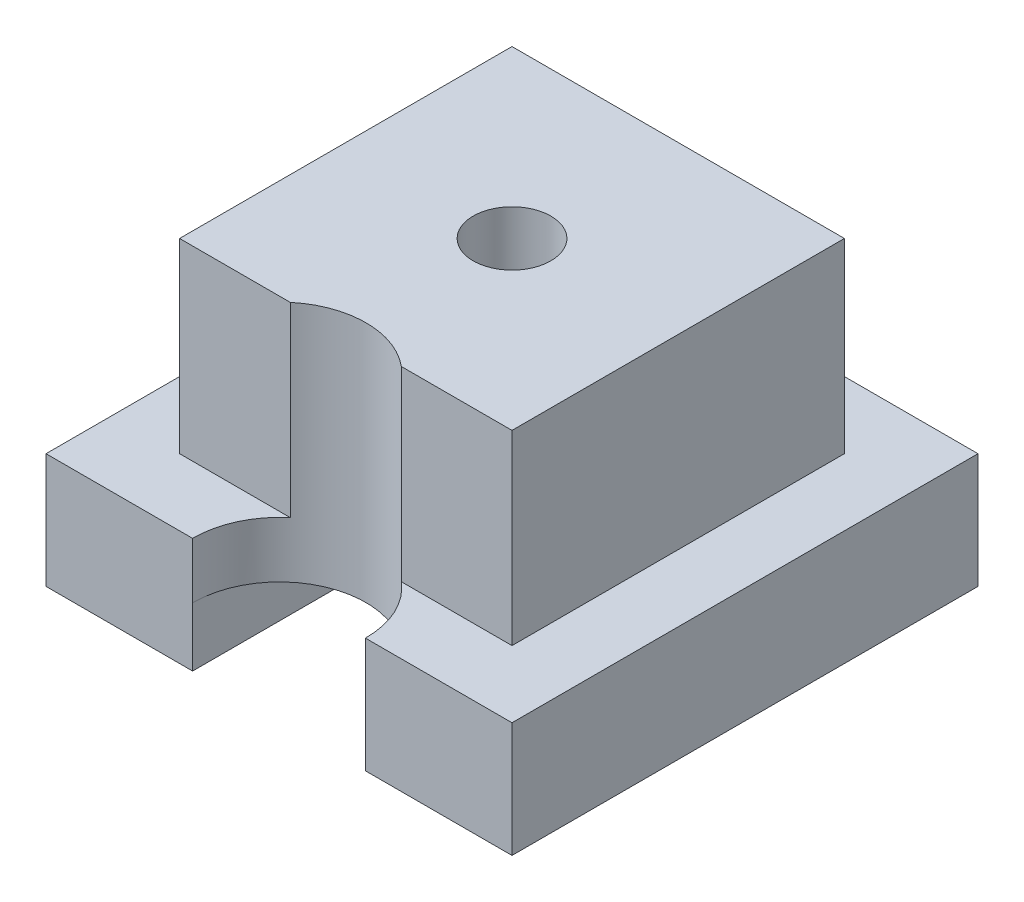
ISO-10303-21;
HEADER;
FILE_DESCRIPTION(('STEP AP214'),'2;1');
FILE_NAME('part.step','',(''),(''),'','','');
FILE_SCHEMA(('AUTOMOTIVE_DESIGN { 1 0 10303 214 1 1 1 1 }'));
ENDSEC;
DATA;
#1=APPLICATION_CONTEXT('core data for automotive mechanical design processes');
#2=APPLICATION_PROTOCOL_DEFINITION('international standard','automotive_design',2000,#1);
#3=PRODUCT_CONTEXT('',#1,'mechanical');
#4=PRODUCT('Part','Part','',(#3));
#5=PRODUCT_RELATED_PRODUCT_CATEGORY('part','',(#4));
#6=PRODUCT_DEFINITION_FORMATION('','',#4);
#7=PRODUCT_DEFINITION_CONTEXT('part definition',#1,'design');
#8=PRODUCT_DEFINITION('design','',#6,#7);
#9=PRODUCT_DEFINITION_SHAPE('','',#8);
#10=(LENGTH_UNIT() NAMED_UNIT(*) SI_UNIT(.MILLI.,.METRE.));
#11=(NAMED_UNIT(*) PLANE_ANGLE_UNIT() SI_UNIT($,.RADIAN.));
#12=(NAMED_UNIT(*) SI_UNIT($,.STERADIAN.) SOLID_ANGLE_UNIT());
#13=UNCERTAINTY_MEASURE_WITH_UNIT(LENGTH_MEASURE(1.E-05),#10,'distance_accuracy_value','');
#14=(GEOMETRIC_REPRESENTATION_CONTEXT(3) GLOBAL_UNCERTAINTY_ASSIGNED_CONTEXT((#13)) GLOBAL_UNIT_ASSIGNED_CONTEXT((#10,
#11,#12)) REPRESENTATION_CONTEXT('',''));
#15=CARTESIAN_POINT('',(0.,0.,0.));
#16=DIRECTION('',(0.,0.,1.));
#17=DIRECTION('',(1.,0.,0.));
#18=AXIS2_PLACEMENT_3D('',#15,#16,#17);
#19=CARTESIAN_POINT('',(0.,0.,0.));
#20=DIRECTION('',(0.,1.,0.));
#21=DIRECTION('',(0.,0.,1.));
#22=AXIS2_PLACEMENT_3D('',#19,#20,#21);
#23=PLANE('',#22);
#24=CARTESIAN_POINT('',(0.,0.,0.));
#25=DIRECTION('',(0.,-1.,0.));
#26=DIRECTION('',(0.,0.,-1.));
#27=AXIS2_PLACEMENT_3D('',#24,#25,#26);
#28=CIRCLE('',#27,3.175);
#29=CARTESIAN_POINT('',(0.,0.,-3.175));
#30=VERTEX_POINT('',#29);
#31=EDGE_CURVE('E272',#30,#30,#28,.T.);
#32=ORIENTED_EDGE('',*,*,#31,.F.);
#33=EDGE_LOOP('',(#32));
#34=FACE_BOUND('',#33,.T.);
#35=DIRECTION('',(0.,0.,1.));
#36=VECTOR('',#35,1.);
#37=CARTESIAN_POINT('',(-7.06332300168908,0.,-19.05));
#38=LINE('',#37,#36);
#39=CARTESIAN_POINT('',(-7.06332300168908,0.,-19.05));
#40=VERTEX_POINT('',#39);
#41=CARTESIAN_POINT('',(-7.06332300168908,0.,18.9499999999997));
#42=VERTEX_POINT('',#41);
#43=EDGE_CURVE('E90',#40,#42,#38,.T.);
#44=ORIENTED_EDGE('',*,*,#43,.F.);
#45=DIRECTION('',(-1.,0.,0.));
#46=VECTOR('',#45,1.);
#47=CARTESIAN_POINT('',(-19.05,0.,-19.05));
#48=LINE('',#47,#46);
#49=CARTESIAN_POINT('',(7.06332300168908,0.,-19.05));
#50=VERTEX_POINT('',#49);
#51=EDGE_CURVE('E338',#50,#40,#48,.T.);
#52=ORIENTED_EDGE('',*,*,#51,.F.);
#53=DIRECTION('',(0.,0.,-1.));
#54=VECTOR('',#53,1.);
#55=CARTESIAN_POINT('',(7.06332300168908,0.,-19.05));
#56=LINE('',#55,#54);
#57=CARTESIAN_POINT('',(7.06332300168908,0.,18.9499999999999));
#58=VERTEX_POINT('',#57);
#59=EDGE_CURVE('E12',#58,#50,#56,.T.);
#60=ORIENTED_EDGE('',*,*,#59,.F.);
#61=CARTESIAN_POINT('',(0.,0.,19.));
#62=DIRECTION('',(0.,-1.,0.));
#63=DIRECTION('',(0.,0.,-1.));
#64=AXIS2_PLACEMENT_3D('',#61,#62,#63);
#65=CIRCLE('',#64,7.06349997);
#66=EDGE_CURVE('E97',#42,#58,#65,.T.);
#67=ORIENTED_EDGE('',*,*,#66,.F.);
#68=EDGE_LOOP('',(#44,#52,#60,#67));
#69=FACE_BOUND('',#68,.T.);
#70=ADVANCED_FACE('F72',(#34,#69),#23,.F.);
#71=CARTESIAN_POINT('',(-19.05,4.572,19.05));
#72=DIRECTION('',(0.,0.,-1.));
#73=DIRECTION('',(-1.,0.,0.));
#74=AXIS2_PLACEMENT_3D('',#71,#72,#73);
#75=PLANE('',#74);
#76=DIRECTION('',(1.,0.,0.));
#77=VECTOR('',#76,1.);
#78=CARTESIAN_POINT('',(-19.05,4.572,19.05));
#79=LINE('',#78,#77);
#80=CARTESIAN_POINT('',(7.06332300168908,4.572,19.05));
#81=VERTEX_POINT('',#80);
#82=CARTESIAN_POINT('',(19.05,4.572,19.05));
#83=VERTEX_POINT('',#82);
#84=EDGE_CURVE('E347',#81,#83,#79,.T.);
#85=ORIENTED_EDGE('',*,*,#84,.F.);
#86=DIRECTION('',(0.,-1.,0.));
#87=VECTOR('',#86,1.);
#88=CARTESIAN_POINT('',(7.06332300168908,19.812,19.05));
#89=LINE('',#88,#87);
#90=CARTESIAN_POINT('',(7.06332300168908,0.,19.05));
#91=VERTEX_POINT('',#90);
#92=EDGE_CURVE('E300',#81,#91,#89,.T.);
#93=ORIENTED_EDGE('',*,*,#92,.T.);
#94=DIRECTION('',(0.,1.,0.));
#95=VECTOR('',#94,1.);
#96=CARTESIAN_POINT('',(7.06332300168908,-4.826,19.05));
#97=LINE('',#96,#95);
#98=CARTESIAN_POINT('',(7.06332300168908,-4.826,19.05));
#99=VERTEX_POINT('',#98);
#100=EDGE_CURVE('E282',#99,#91,#97,.T.);
#101=ORIENTED_EDGE('',*,*,#100,.F.);
#102=DIRECTION('',(-1.,0.,0.));
#103=VECTOR('',#102,1.);
#104=CARTESIAN_POINT('',(19.05,-4.826,19.05));
#105=LINE('',#104,#103);
#106=CARTESIAN_POINT('',(19.05,-4.826,19.05));
#107=VERTEX_POINT('',#106);
#108=EDGE_CURVE('E422',#107,#99,#105,.T.);
#109=ORIENTED_EDGE('',*,*,#108,.F.);
#110=DIRECTION('',(0.,-1.,0.));
#111=VECTOR('',#110,1.);
#112=CARTESIAN_POINT('',(19.05,4.572,19.05));
#113=LINE('',#112,#111);
#114=EDGE_CURVE('E351',#83,#107,#113,.T.);
#115=ORIENTED_EDGE('',*,*,#114,.F.);
#116=EDGE_LOOP('',(#85,#93,#101,#109,#115));
#117=FACE_BOUND('',#116,.T.);
#118=ADVANCED_FACE('F423',(#117),#75,.F.);
#119=CARTESIAN_POINT('',(-13.589,19.812,13.589));
#120=DIRECTION('',(0.,0.,-1.));
#121=DIRECTION('',(-1.,0.,0.));
#122=AXIS2_PLACEMENT_3D('',#119,#120,#121);
#123=PLANE('',#122);
#124=DIRECTION('',(1.,0.,0.));
#125=VECTOR('',#124,1.);
#126=CARTESIAN_POINT('',(-13.589,19.812,13.589));
#127=LINE('',#126,#125);
#128=CARTESIAN_POINT('',(4.54027651428743,19.812,13.589));
#129=VERTEX_POINT('',#128);
#130=CARTESIAN_POINT('',(13.589,19.812,13.589));
#131=VERTEX_POINT('',#130);
#132=EDGE_CURVE('E306',#129,#131,#127,.T.);
#133=ORIENTED_EDGE('',*,*,#132,.F.);
#134=DIRECTION('',(0.,-1.,0.));
#135=VECTOR('',#134,1.);
#136=CARTESIAN_POINT('',(4.54027651428744,19.812,13.589));
#137=LINE('',#136,#135);
#138=CARTESIAN_POINT('',(4.54027651428744,4.572,13.589));
#139=VERTEX_POINT('',#138);
#140=EDGE_CURVE('E293',#129,#139,#137,.T.);
#141=ORIENTED_EDGE('',*,*,#140,.T.);
#142=DIRECTION('',(-1.,0.,0.));
#143=VECTOR('',#142,1.);
#144=CARTESIAN_POINT('',(0.,4.572,13.589));
#145=LINE('',#144,#143);
#146=CARTESIAN_POINT('',(13.589,4.572,13.589));
#147=VERTEX_POINT('',#146);
#148=EDGE_CURVE('E324',#147,#139,#145,.T.);
#149=ORIENTED_EDGE('',*,*,#148,.F.);
#150=DIRECTION('',(0.,-1.,0.));
#151=VECTOR('',#150,1.);
#152=CARTESIAN_POINT('',(13.589,19.812,13.589));
#153=LINE('',#152,#151);
#154=EDGE_CURVE('E310',#131,#147,#153,.T.);
#155=ORIENTED_EDGE('',*,*,#154,.F.);
#156=EDGE_LOOP('',(#133,#141,#149,#155));
#157=FACE_BOUND('',#156,.T.);
#158=ADVANCED_FACE('F399',(#157),#123,.F.);
#159=CARTESIAN_POINT('',(0.,4.572,0.));
#160=DIRECTION('',(0.,1.,0.));
#161=DIRECTION('',(0.,0.,1.));
#162=AXIS2_PLACEMENT_3D('',#159,#160,#161);
#163=PLANE('',#162);
#164=CARTESIAN_POINT('',(0.,4.572,19.));
#165=DIRECTION('',(0.,1.,0.));
#166=DIRECTION('',(0.,0.,1.));
#167=AXIS2_PLACEMENT_3D('',#164,#165,#166);
#168=CIRCLE('',#167,7.06349997);
#169=EDGE_CURVE('E292',#81,#139,#168,.T.);
#170=ORIENTED_EDGE('',*,*,#169,.F.);
#171=ORIENTED_EDGE('',*,*,#84,.T.);
#172=DIRECTION('',(0.,0.,-1.));
#173=VECTOR('',#172,1.);
#174=CARTESIAN_POINT('',(19.05,4.572,-19.05));
#175=LINE('',#174,#173);
#176=CARTESIAN_POINT('',(19.05,4.572,-19.05));
#177=VERTEX_POINT('',#176);
#178=EDGE_CURVE('E339',#83,#177,#175,.T.);
#179=ORIENTED_EDGE('',*,*,#178,.T.);
#180=DIRECTION('',(-1.,0.,0.));
#181=VECTOR('',#180,1.);
#182=CARTESIAN_POINT('',(-19.05,4.572,-19.05));
#183=LINE('',#182,#181);
#184=CARTESIAN_POINT('',(-19.05,4.572,-19.05));
#185=VERTEX_POINT('',#184);
#186=EDGE_CURVE('E342',#177,#185,#183,.T.);
#187=ORIENTED_EDGE('',*,*,#186,.T.);
#188=DIRECTION('',(0.,0.,1.));
#189=VECTOR('',#188,1.);
#190=CARTESIAN_POINT('',(-19.05,4.572,-19.05));
#191=LINE('',#190,#189);
#192=CARTESIAN_POINT('',(-19.05,4.572,19.05));
#193=VERTEX_POINT('',#192);
#194=EDGE_CURVE('E200',#185,#193,#191,.T.);
#195=ORIENTED_EDGE('',*,*,#194,.T.);
#196=CARTESIAN_POINT('',(-7.06332300168908,4.572,19.05));
#197=VERTEX_POINT('',#196);
#198=EDGE_CURVE('E348',#193,#197,#79,.T.);
#199=ORIENTED_EDGE('',*,*,#198,.T.);
#200=CARTESIAN_POINT('',(-4.54027651428744,4.572,13.589));
#201=VERTEX_POINT('',#200);
#202=EDGE_CURVE('E289',#201,#197,#168,.T.);
#203=ORIENTED_EDGE('',*,*,#202,.F.);
#204=CARTESIAN_POINT('',(-13.589,4.572,13.589));
#205=VERTEX_POINT('',#204);
#206=EDGE_CURVE('E323',#201,#205,#145,.T.);
#207=ORIENTED_EDGE('',*,*,#206,.T.);
#208=DIRECTION('',(0.,0.,-1.));
#209=VECTOR('',#208,1.);
#210=CARTESIAN_POINT('',(-13.589,4.572,0.));
#211=LINE('',#210,#209);
#212=CARTESIAN_POINT('',(-13.589,4.572,-13.589));
#213=VERTEX_POINT('',#212);
#214=EDGE_CURVE('E327',#205,#213,#211,.T.);
#215=ORIENTED_EDGE('',*,*,#214,.T.);
#216=DIRECTION('',(1.,0.,0.));
#217=VECTOR('',#216,1.);
#218=CARTESIAN_POINT('',(0.,4.572,-13.589));
#219=LINE('',#218,#217);
#220=CARTESIAN_POINT('',(13.589,4.572,-13.589));
#221=VERTEX_POINT('',#220);
#222=EDGE_CURVE('E331',#213,#221,#219,.T.);
#223=ORIENTED_EDGE('',*,*,#222,.T.);
#224=DIRECTION('',(0.,0.,1.));
#225=VECTOR('',#224,1.);
#226=CARTESIAN_POINT('',(13.589,4.572,0.));
#227=LINE('',#226,#225);
#228=EDGE_CURVE('E335',#221,#147,#227,.T.);
#229=ORIENTED_EDGE('',*,*,#228,.T.);
#230=ORIENTED_EDGE('',*,*,#148,.T.);
#231=EDGE_LOOP('',(#170,#171,#179,#187,#195,#199,#203,#207,#215,#223,#229,#230));
#232=FACE_BOUND('',#231,.T.);
#233=ADVANCED_FACE('F401',(#232),#163,.T.);
#234=CARTESIAN_POINT('',(19.05,4.572,-19.05));
#235=DIRECTION('',(-1.,0.,0.));
#236=DIRECTION('',(0.,0.,1.));
#237=AXIS2_PLACEMENT_3D('',#234,#235,#236);
#238=PLANE('',#237);
#239=ORIENTED_EDGE('',*,*,#114,.T.);
#240=DIRECTION('',(0.,0.,1.));
#241=VECTOR('',#240,1.);
#242=CARTESIAN_POINT('',(19.05,-4.826,-19.05));
#243=LINE('',#242,#241);
#244=CARTESIAN_POINT('',(19.05,-4.826,-19.05));
#245=VERTEX_POINT('',#244);
#246=EDGE_CURVE('E242',#245,#107,#243,.T.);
#247=ORIENTED_EDGE('',*,*,#246,.F.);
#248=DIRECTION('',(0.,-1.,0.));
#249=VECTOR('',#248,1.);
#250=CARTESIAN_POINT('',(19.05,4.572,-19.05));
#251=LINE('',#250,#249);
#252=EDGE_CURVE('E203',#177,#245,#251,.T.);
#253=ORIENTED_EDGE('',*,*,#252,.F.);
#254=ORIENTED_EDGE('',*,*,#178,.F.);
#255=EDGE_LOOP('',(#239,#247,#253,#254));
#256=FACE_BOUND('',#255,.T.);
#257=ADVANCED_FACE('F74',(#256),#238,.F.);
#258=CARTESIAN_POINT('',(-19.05,4.572,-19.05));
#259=DIRECTION('',(0.,0.,1.));
#260=DIRECTION('',(1.,0.,0.));
#261=AXIS2_PLACEMENT_3D('',#258,#259,#260);
#262=PLANE('',#261);
#263=ORIENTED_EDGE('',*,*,#252,.T.);
#264=DIRECTION('',(1.,0.,0.));
#265=VECTOR('',#264,1.);
#266=CARTESIAN_POINT('',(19.05,-4.826,-19.05));
#267=LINE('',#266,#265);
#268=CARTESIAN_POINT('',(7.06332300168908,-4.826,-19.05));
#269=VERTEX_POINT('',#268);
#270=EDGE_CURVE('E365',#269,#245,#267,.T.);
#271=ORIENTED_EDGE('',*,*,#270,.F.);
#272=DIRECTION('',(0.,1.,0.));
#273=VECTOR('',#272,1.);
#274=CARTESIAN_POINT('',(7.06332300168908,-4.826,-19.05));
#275=LINE('',#274,#273);
#276=EDGE_CURVE('E368',#269,#50,#275,.T.);
#277=ORIENTED_EDGE('',*,*,#276,.T.);
#278=ORIENTED_EDGE('',*,*,#51,.T.);
#279=DIRECTION('',(0.,1.,0.));
#280=VECTOR('',#279,1.);
#281=CARTESIAN_POINT('',(-7.06332300168908,-4.826,-19.05));
#282=LINE('',#281,#280);
#283=CARTESIAN_POINT('',(-7.06332300168908,-4.826,-19.05));
#284=VERTEX_POINT('',#283);
#285=EDGE_CURVE('E210',#284,#40,#282,.T.);
#286=ORIENTED_EDGE('',*,*,#285,.F.);
#287=DIRECTION('',(1.,0.,0.));
#288=VECTOR('',#287,1.);
#289=CARTESIAN_POINT('',(-19.05,-4.826,-19.05));
#290=LINE('',#289,#288);
#291=CARTESIAN_POINT('',(-19.05,-4.826,-19.05));
#292=VERTEX_POINT('',#291);
#293=EDGE_CURVE('E207',#292,#284,#290,.T.);
#294=ORIENTED_EDGE('',*,*,#293,.F.);
#295=DIRECTION('',(0.,-1.,0.));
#296=VECTOR('',#295,1.);
#297=CARTESIAN_POINT('',(-19.05,4.572,-19.05));
#298=LINE('',#297,#296);
#299=EDGE_CURVE('E194',#185,#292,#298,.T.);
#300=ORIENTED_EDGE('',*,*,#299,.F.);
#301=ORIENTED_EDGE('',*,*,#186,.F.);
#302=EDGE_LOOP('',(#263,#271,#277,#278,#286,#294,#300,#301));
#303=FACE_BOUND('',#302,.T.);
#304=ADVANCED_FACE('F208',(#303),#262,.F.);
#305=CARTESIAN_POINT('',(-19.05,4.572,-19.05));
#306=DIRECTION('',(1.,0.,0.));
#307=DIRECTION('',(0.,0.,-1.));
#308=AXIS2_PLACEMENT_3D('',#305,#306,#307);
#309=PLANE('',#308);
#310=ORIENTED_EDGE('',*,*,#299,.T.);
#311=DIRECTION('',(0.,0.,-1.));
#312=VECTOR('',#311,1.);
#313=CARTESIAN_POINT('',(-19.05,-4.826,-19.05));
#314=LINE('',#313,#312);
#315=CARTESIAN_POINT('',(-19.05,-4.826,19.05));
#316=VERTEX_POINT('',#315);
#317=EDGE_CURVE('E199',#316,#292,#314,.T.);
#318=ORIENTED_EDGE('',*,*,#317,.F.);
#319=DIRECTION('',(0.,-1.,0.));
#320=VECTOR('',#319,1.);
#321=CARTESIAN_POINT('',(-19.05,4.572,19.05));
#322=LINE('',#321,#320);
#323=EDGE_CURVE('E204',#193,#316,#322,.T.);
#324=ORIENTED_EDGE('',*,*,#323,.F.);
#325=ORIENTED_EDGE('',*,*,#194,.F.);
#326=EDGE_LOOP('',(#310,#318,#324,#325));
#327=FACE_BOUND('',#326,.T.);
#328=ADVANCED_FACE('F196',(#327),#309,.F.);
#329=ORIENTED_EDGE('',*,*,#323,.T.);
#330=DIRECTION('',(-1.,0.,0.));
#331=VECTOR('',#330,1.);
#332=CARTESIAN_POINT('',(-19.05,-4.826,19.05));
#333=LINE('',#332,#331);
#334=CARTESIAN_POINT('',(-7.06332300168908,-4.826,19.05));
#335=VERTEX_POINT('',#334);
#336=EDGE_CURVE('E219',#335,#316,#333,.T.);
#337=ORIENTED_EDGE('',*,*,#336,.F.);
#338=DIRECTION('',(0.,1.,0.));
#339=VECTOR('',#338,1.);
#340=CARTESIAN_POINT('',(-7.06332300168908,-4.826,19.05));
#341=LINE('',#340,#339);
#342=CARTESIAN_POINT('',(-7.06332300168908,0.,19.05));
#343=VERTEX_POINT('',#342);
#344=EDGE_CURVE('E227',#335,#343,#341,.T.);
#345=ORIENTED_EDGE('',*,*,#344,.T.);
#346=DIRECTION('',(0.,-1.,0.));
#347=VECTOR('',#346,1.);
#348=CARTESIAN_POINT('',(-7.06332300168908,19.812,19.05));
#349=LINE('',#348,#347);
#350=EDGE_CURVE('E291',#343,#197,#349,.F.);
#351=ORIENTED_EDGE('',*,*,#350,.T.);
#352=ORIENTED_EDGE('',*,*,#198,.F.);
#353=EDGE_LOOP('',(#329,#337,#345,#351,#352));
#354=FACE_BOUND('',#353,.T.);
#355=ADVANCED_FACE('F427',(#354),#75,.F.);
#356=CARTESIAN_POINT('',(13.589,19.812,-13.589));
#357=DIRECTION('',(-1.,0.,0.));
#358=DIRECTION('',(0.,0.,1.));
#359=AXIS2_PLACEMENT_3D('',#356,#357,#358);
#360=PLANE('',#359);
#361=ORIENTED_EDGE('',*,*,#228,.F.);
#362=DIRECTION('',(0.,-1.,0.));
#363=VECTOR('',#362,1.);
#364=CARTESIAN_POINT('',(13.589,19.812,-13.589));
#365=LINE('',#364,#363);
#366=CARTESIAN_POINT('',(13.589,19.812,-13.589));
#367=VERTEX_POINT('',#366);
#368=EDGE_CURVE('E320',#367,#221,#365,.T.);
#369=ORIENTED_EDGE('',*,*,#368,.F.);
#370=DIRECTION('',(0.,0.,-1.));
#371=VECTOR('',#370,1.);
#372=CARTESIAN_POINT('',(13.589,19.812,-13.589));
#373=LINE('',#372,#371);
#374=EDGE_CURVE('E296',#131,#367,#373,.T.);
#375=ORIENTED_EDGE('',*,*,#374,.F.);
#376=ORIENTED_EDGE('',*,*,#154,.T.);
#377=EDGE_LOOP('',(#361,#369,#375,#376));
#378=FACE_BOUND('',#377,.T.);
#379=ADVANCED_FACE('F404',(#378),#360,.F.);
#380=CARTESIAN_POINT('',(-13.589,19.812,-13.589));
#381=DIRECTION('',(0.,0.,1.));
#382=DIRECTION('',(1.,0.,0.));
#383=AXIS2_PLACEMENT_3D('',#380,#381,#382);
#384=PLANE('',#383);
#385=ORIENTED_EDGE('',*,*,#222,.F.);
#386=DIRECTION('',(0.,-1.,0.));
#387=VECTOR('',#386,1.);
#388=CARTESIAN_POINT('',(-13.589,19.812,-13.589));
#389=LINE('',#388,#387);
#390=CARTESIAN_POINT('',(-13.589,19.812,-13.589));
#391=VERTEX_POINT('',#390);
#392=EDGE_CURVE('E316',#391,#213,#389,.T.);
#393=ORIENTED_EDGE('',*,*,#392,.F.);
#394=DIRECTION('',(-1.,0.,0.));
#395=VECTOR('',#394,1.);
#396=CARTESIAN_POINT('',(-13.589,19.812,-13.589));
#397=LINE('',#396,#395);
#398=EDGE_CURVE('E299',#367,#391,#397,.T.);
#399=ORIENTED_EDGE('',*,*,#398,.F.);
#400=ORIENTED_EDGE('',*,*,#368,.T.);
#401=EDGE_LOOP('',(#385,#393,#399,#400));
#402=FACE_BOUND('',#401,.T.);
#403=ADVANCED_FACE('F407',(#402),#384,.F.);
#404=CARTESIAN_POINT('',(-13.589,19.812,-13.589));
#405=DIRECTION('',(1.,0.,0.));
#406=DIRECTION('',(0.,0.,-1.));
#407=AXIS2_PLACEMENT_3D('',#404,#405,#406);
#408=PLANE('',#407);
#409=ORIENTED_EDGE('',*,*,#214,.F.);
#410=DIRECTION('',(0.,-1.,0.));
#411=VECTOR('',#410,1.);
#412=CARTESIAN_POINT('',(-13.589,19.812,13.589));
#413=LINE('',#412,#411);
#414=CARTESIAN_POINT('',(-13.589,19.812,13.589));
#415=VERTEX_POINT('',#414);
#416=EDGE_CURVE('E313',#415,#205,#413,.T.);
#417=ORIENTED_EDGE('',*,*,#416,.F.);
#418=DIRECTION('',(0.,0.,1.));
#419=VECTOR('',#418,1.);
#420=CARTESIAN_POINT('',(-13.589,19.812,-13.589));
#421=LINE('',#420,#419);
#422=EDGE_CURVE('E303',#391,#415,#421,.T.);
#423=ORIENTED_EDGE('',*,*,#422,.F.);
#424=ORIENTED_EDGE('',*,*,#392,.T.);
#425=EDGE_LOOP('',(#409,#417,#423,#424));
#426=FACE_BOUND('',#425,.T.);
#427=ADVANCED_FACE('F446',(#426),#408,.F.);
#428=ORIENTED_EDGE('',*,*,#206,.F.);
#429=DIRECTION('',(0.,-1.,0.));
#430=VECTOR('',#429,1.);
#431=CARTESIAN_POINT('',(-4.54027651428744,19.812,13.589));
#432=LINE('',#431,#430);
#433=CARTESIAN_POINT('',(-4.54027651428743,19.812,13.589));
#434=VERTEX_POINT('',#433);
#435=EDGE_CURVE('E286',#201,#434,#432,.F.);
#436=ORIENTED_EDGE('',*,*,#435,.T.);
#437=EDGE_CURVE('E307',#415,#434,#127,.T.);
#438=ORIENTED_EDGE('',*,*,#437,.F.);
#439=ORIENTED_EDGE('',*,*,#416,.T.);
#440=EDGE_LOOP('',(#428,#436,#438,#439));
#441=FACE_BOUND('',#440,.T.);
#442=ADVANCED_FACE('F442',(#441),#123,.F.);
#443=CARTESIAN_POINT('',(0.,19.812,0.));
#444=DIRECTION('',(0.,1.,0.));
#445=DIRECTION('',(0.,0.,1.));
#446=AXIS2_PLACEMENT_3D('',#443,#444,#445);
#447=PLANE('',#446);
#448=CARTESIAN_POINT('',(0.,19.812,0.));
#449=DIRECTION('',(0.,-1.,0.));
#450=DIRECTION('',(0.,0.,-1.));
#451=AXIS2_PLACEMENT_3D('',#448,#449,#450);
#452=CIRCLE('',#451,3.175);
#453=CARTESIAN_POINT('',(0.,19.812,-3.175));
#454=VERTEX_POINT('',#453);
#455=EDGE_CURVE('E281',#454,#454,#452,.T.);
#456=ORIENTED_EDGE('',*,*,#455,.T.);
#457=EDGE_LOOP('',(#456));
#458=FACE_BOUND('',#457,.T.);
#459=CARTESIAN_POINT('',(0.,19.812,19.));
#460=DIRECTION('',(0.,1.,0.));
#461=DIRECTION('',(0.,0.,1.));
#462=AXIS2_PLACEMENT_3D('',#459,#460,#461);
#463=CIRCLE('',#462,7.06349997);
#464=EDGE_CURVE('E82',#129,#434,#463,.T.);
#465=ORIENTED_EDGE('',*,*,#464,.F.);
#466=ORIENTED_EDGE('',*,*,#132,.T.);
#467=ORIENTED_EDGE('',*,*,#374,.T.);
#468=ORIENTED_EDGE('',*,*,#398,.T.);
#469=ORIENTED_EDGE('',*,*,#422,.T.);
#470=ORIENTED_EDGE('',*,*,#437,.T.);
#471=EDGE_LOOP('',(#465,#466,#467,#468,#469,#470));
#472=FACE_BOUND('',#471,.T.);
#473=ADVANCED_FACE('F411',(#458,#472),#447,.T.);
#474=CARTESIAN_POINT('',(0.,19.812,19.));
#475=DIRECTION('',(0.,-1.,0.));
#476=DIRECTION('',(0.,0.,-1.));
#477=AXIS2_PLACEMENT_3D('',#474,#475,#476);
#478=CYLINDRICAL_SURFACE('',#477,7.06349997);
#479=ORIENTED_EDGE('',*,*,#169,.T.);
#480=ORIENTED_EDGE('',*,*,#140,.F.);
#481=ORIENTED_EDGE('',*,*,#464,.T.);
#482=ORIENTED_EDGE('',*,*,#435,.F.);
#483=ORIENTED_EDGE('',*,*,#202,.T.);
#484=ORIENTED_EDGE('',*,*,#350,.F.);
#485=CARTESIAN_POINT('',(0.,0.,19.));
#486=DIRECTION('',(0.,-1.,0.));
#487=DIRECTION('',(-0.999974946087397,0.,0.00707864376192501));
#488=AXIS2_PLACEMENT_3D('',#485,#486,#487);
#489=CIRCLE('',#488,7.06349997);
#490=EDGE_CURVE('E236',#343,#42,#489,.T.);
#491=ORIENTED_EDGE('',*,*,#490,.T.);
#492=ORIENTED_EDGE('',*,*,#66,.T.);
#493=CARTESIAN_POINT('',(0.,0.,19.));
#494=DIRECTION('',(0.,-1.,0.));
#495=DIRECTION('',(0.999974946087396,0.,-0.00707864376194269));
#496=AXIS2_PLACEMENT_3D('',#493,#494,#495);
#497=CIRCLE('',#496,7.06349997);
#498=EDGE_CURVE('E285',#58,#91,#497,.T.);
#499=ORIENTED_EDGE('',*,*,#498,.T.);
#500=ORIENTED_EDGE('',*,*,#92,.F.);
#501=EDGE_LOOP('',(#479,#480,#481,#482,#483,#484,#491,#492,#499,#500));
#502=FACE_BOUND('',#501,.T.);
#503=ADVANCED_FACE('F394',(#502),#478,.F.);
#504=CARTESIAN_POINT('',(0.,0.,0.));
#505=DIRECTION('',(0.,-1.,0.));
#506=DIRECTION('',(0.,0.,-1.));
#507=AXIS2_PLACEMENT_3D('',#504,#505,#506);
#508=CYLINDRICAL_SURFACE('',#507,3.175);
#509=ORIENTED_EDGE('',*,*,#455,.F.);
#510=EDGE_LOOP('',(#509));
#511=FACE_BOUND('',#510,.T.);
#512=ORIENTED_EDGE('',*,*,#31,.T.);
#513=EDGE_LOOP('',(#512));
#514=FACE_BOUND('',#513,.T.);
#515=ADVANCED_FACE('F262',(#511,#514),#508,.F.);
#516=CARTESIAN_POINT('',(7.06332300168908,-4.826,-19.05));
#517=DIRECTION('',(1.,0.,0.));
#518=DIRECTION('',(0.,0.,-1.));
#519=AXIS2_PLACEMENT_3D('',#516,#517,#518);
#520=PLANE('',#519);
#521=ORIENTED_EDGE('',*,*,#498,.F.);
#522=ORIENTED_EDGE('',*,*,#59,.T.);
#523=ORIENTED_EDGE('',*,*,#276,.F.);
#524=DIRECTION('',(0.,0.,-1.));
#525=VECTOR('',#524,1.);
#526=CARTESIAN_POINT('',(7.06332300168908,-4.826,-19.05));
#527=LINE('',#526,#525);
#528=EDGE_CURVE('E377',#99,#269,#527,.T.);
#529=ORIENTED_EDGE('',*,*,#528,.F.);
#530=ORIENTED_EDGE('',*,*,#100,.T.);
#531=EDGE_LOOP('',(#521,#522,#523,#529,#530));
#532=FACE_BOUND('',#531,.T.);
#533=ADVANCED_FACE('F257',(#532),#520,.F.);
#534=CARTESIAN_POINT('',(0.,-4.826,0.));
#535=DIRECTION('',(0.,-1.,0.));
#536=DIRECTION('',(0.,0.,-1.));
#537=AXIS2_PLACEMENT_3D('',#534,#535,#536);
#538=PLANE('',#537);
#539=ORIENTED_EDGE('',*,*,#246,.T.);
#540=ORIENTED_EDGE('',*,*,#108,.T.);
#541=ORIENTED_EDGE('',*,*,#528,.T.);
#542=ORIENTED_EDGE('',*,*,#270,.T.);
#543=EDGE_LOOP('',(#539,#540,#541,#542));
#544=FACE_BOUND('',#543,.T.);
#545=ADVANCED_FACE('F254',(#544),#538,.T.);
#546=CARTESIAN_POINT('',(-7.06332300168908,-4.826,-19.05));
#547=DIRECTION('',(-1.,0.,0.));
#548=DIRECTION('',(0.,0.,1.));
#549=AXIS2_PLACEMENT_3D('',#546,#547,#548);
#550=PLANE('',#549);
#551=ORIENTED_EDGE('',*,*,#43,.T.);
#552=ORIENTED_EDGE('',*,*,#490,.F.);
#553=ORIENTED_EDGE('',*,*,#344,.F.);
#554=DIRECTION('',(0.,0.,1.));
#555=VECTOR('',#554,1.);
#556=CARTESIAN_POINT('',(-7.06332300168908,-4.826,-19.05));
#557=LINE('',#556,#555);
#558=EDGE_CURVE('E214',#284,#335,#557,.T.);
#559=ORIENTED_EDGE('',*,*,#558,.F.);
#560=ORIENTED_EDGE('',*,*,#285,.T.);
#561=EDGE_LOOP('',(#551,#552,#553,#559,#560));
#562=FACE_BOUND('',#561,.T.);
#563=ADVANCED_FACE('F244',(#562),#550,.F.);
#564=CARTESIAN_POINT('',(0.,-4.826,0.));
#565=DIRECTION('',(0.,1.,0.));
#566=DIRECTION('',(0.,0.,1.));
#567=AXIS2_PLACEMENT_3D('',#564,#565,#566);
#568=PLANE('',#567);
#569=ORIENTED_EDGE('',*,*,#317,.T.);
#570=ORIENTED_EDGE('',*,*,#293,.T.);
#571=ORIENTED_EDGE('',*,*,#558,.T.);
#572=ORIENTED_EDGE('',*,*,#336,.T.);
#573=EDGE_LOOP('',(#569,#570,#571,#572));
#574=FACE_BOUND('',#573,.T.);
#575=ADVANCED_FACE('F217',(#574),#568,.F.);
#576=CLOSED_SHELL('',(#70,#118,#158,#233,#257,#304,#328,#355,#379,#403,#427,#442,#473,#503,#515,
#533,#545,#563,#575));
#577=MANIFOLD_SOLID_BREP('B2',#576);
#578=ADVANCED_BREP_SHAPE_REPRESENTATION('',(#18,#577),#14);
#579=SHAPE_DEFINITION_REPRESENTATION(#9,#578);
ENDSEC;
END-ISO-10303-21;
